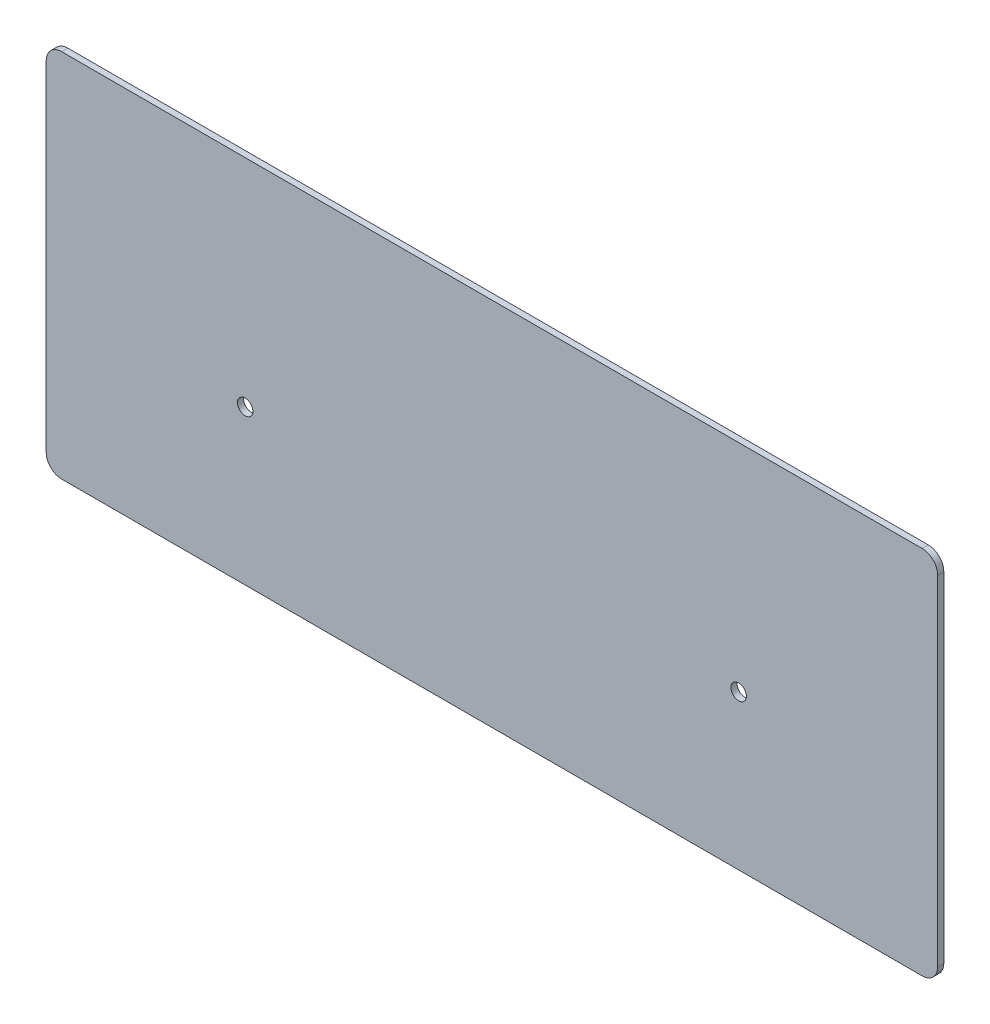
ISO-10303-21;
HEADER;
FILE_DESCRIPTION(('STEP AP214'),'2;1');
FILE_NAME('part.step','',(''),(''),'','','');
FILE_SCHEMA(('AUTOMOTIVE_DESIGN { 1 0 10303 214 1 1 1 1 }'));
ENDSEC;
DATA;
#1=APPLICATION_CONTEXT('core data for automotive mechanical design processes');
#2=APPLICATION_PROTOCOL_DEFINITION('international standard','automotive_design',2000,#1);
#3=PRODUCT_CONTEXT('',#1,'mechanical');
#4=PRODUCT('Part','Part','',(#3));
#5=PRODUCT_RELATED_PRODUCT_CATEGORY('part','',(#4));
#6=PRODUCT_DEFINITION_FORMATION('','',#4);
#7=PRODUCT_DEFINITION_CONTEXT('part definition',#1,'design');
#8=PRODUCT_DEFINITION('design','',#6,#7);
#9=PRODUCT_DEFINITION_SHAPE('','',#8);
#10=(LENGTH_UNIT() NAMED_UNIT(*) SI_UNIT(.MILLI.,.METRE.));
#11=(NAMED_UNIT(*) PLANE_ANGLE_UNIT() SI_UNIT($,.RADIAN.));
#12=(NAMED_UNIT(*) SI_UNIT($,.STERADIAN.) SOLID_ANGLE_UNIT());
#13=UNCERTAINTY_MEASURE_WITH_UNIT(LENGTH_MEASURE(1.E-05),#10,'distance_accuracy_value','');
#14=(GEOMETRIC_REPRESENTATION_CONTEXT(3) GLOBAL_UNCERTAINTY_ASSIGNED_CONTEXT((#13)) GLOBAL_UNIT_ASSIGNED_CONTEXT((#10,
#11,#12)) REPRESENTATION_CONTEXT('',''));
#15=CARTESIAN_POINT('',(0.,0.,0.));
#16=DIRECTION('',(0.,0.,1.));
#17=DIRECTION('',(1.,0.,0.));
#18=AXIS2_PLACEMENT_3D('',#15,#16,#17);
#19=CARTESIAN_POINT('',(-144.5,60.,0.));
#20=DIRECTION('',(0.,-1.,0.));
#21=DIRECTION('',(-1.,0.,0.));
#22=AXIS2_PLACEMENT_3D('',#19,#20,#21);
#23=PLANE('',#22);
#24=DIRECTION('',(0.,0.,1.));
#25=VECTOR('',#24,1.);
#26=CARTESIAN_POINT('',(139.5,60.,0.));
#27=LINE('',#26,#25);
#28=CARTESIAN_POINT('',(139.5,60.,-2.));
#29=VERTEX_POINT('',#28);
#30=CARTESIAN_POINT('',(139.5,60.,0.));
#31=VERTEX_POINT('',#30);
#32=EDGE_CURVE('E11',#29,#31,#27,.T.);
#33=ORIENTED_EDGE('',*,*,#32,.F.);
#34=DIRECTION('',(-1.,0.,0.));
#35=VECTOR('',#34,1.);
#36=CARTESIAN_POINT('',(0.,60.,-2.));
#37=LINE('',#36,#35);
#38=CARTESIAN_POINT('',(-139.5,60.,-2.));
#39=VERTEX_POINT('',#38);
#40=EDGE_CURVE('E110',#29,#39,#37,.T.);
#41=ORIENTED_EDGE('',*,*,#40,.T.);
#42=DIRECTION('',(0.,0.,1.));
#43=VECTOR('',#42,1.);
#44=CARTESIAN_POINT('',(-139.5,60.,0.));
#45=LINE('',#44,#43);
#46=CARTESIAN_POINT('',(-139.5,60.,0.));
#47=VERTEX_POINT('',#46);
#48=EDGE_CURVE('E51',#39,#47,#45,.T.);
#49=ORIENTED_EDGE('',*,*,#48,.T.);
#50=DIRECTION('',(-1.,0.,0.));
#51=VECTOR('',#50,1.);
#52=CARTESIAN_POINT('',(-144.5,60.,0.));
#53=LINE('',#52,#51);
#54=EDGE_CURVE('E154',#31,#47,#53,.T.);
#55=ORIENTED_EDGE('',*,*,#54,.F.);
#56=EDGE_LOOP('',(#33,#41,#49,#55));
#57=FACE_BOUND('',#56,.T.);
#58=ADVANCED_FACE('F41',(#57),#23,.F.);
#59=CARTESIAN_POINT('',(-139.5,55.,0.));
#60=DIRECTION('',(0.,0.,-1.));
#61=DIRECTION('',(-1.,0.,0.));
#62=AXIS2_PLACEMENT_3D('',#59,#60,#61);
#63=CYLINDRICAL_SURFACE('',#62,5.);
#64=ORIENTED_EDGE('',*,*,#48,.F.);
#65=CARTESIAN_POINT('',(-139.5,55.,-2.));
#66=DIRECTION('',(0.,0.,-1.));
#67=DIRECTION('',(-1.,0.,0.));
#68=AXIS2_PLACEMENT_3D('',#65,#66,#67);
#69=CIRCLE('',#68,5.);
#70=CARTESIAN_POINT('',(-144.5,55.,-2.));
#71=VERTEX_POINT('',#70);
#72=EDGE_CURVE('E131',#39,#71,#69,.F.);
#73=ORIENTED_EDGE('',*,*,#72,.T.);
#74=DIRECTION('',(0.,0.,1.));
#75=VECTOR('',#74,1.);
#76=CARTESIAN_POINT('',(-144.5,55.,0.));
#77=LINE('',#76,#75);
#78=CARTESIAN_POINT('',(-144.5,55.,0.));
#79=VERTEX_POINT('',#78);
#80=EDGE_CURVE('E147',#71,#79,#77,.T.);
#81=ORIENTED_EDGE('',*,*,#80,.T.);
#82=CARTESIAN_POINT('',(-139.5,55.,0.));
#83=DIRECTION('',(0.,0.,-1.));
#84=DIRECTION('',(-1.,0.,0.));
#85=AXIS2_PLACEMENT_3D('',#82,#83,#84);
#86=CIRCLE('',#85,5.);
#87=EDGE_CURVE('E164',#47,#79,#86,.F.);
#88=ORIENTED_EDGE('',*,*,#87,.F.);
#89=EDGE_LOOP('',(#64,#73,#81,#88));
#90=FACE_BOUND('',#89,.T.);
#91=ADVANCED_FACE('F167',(#90),#63,.T.);
#92=CARTESIAN_POINT('',(-144.5,-60.,0.));
#93=DIRECTION('',(1.,0.,0.));
#94=DIRECTION('',(0.,-1.,0.));
#95=AXIS2_PLACEMENT_3D('',#92,#93,#94);
#96=PLANE('',#95);
#97=ORIENTED_EDGE('',*,*,#80,.F.);
#98=DIRECTION('',(0.,1.,0.));
#99=VECTOR('',#98,1.);
#100=CARTESIAN_POINT('',(-144.5,0.,-2.));
#101=LINE('',#100,#99);
#102=CARTESIAN_POINT('',(-144.5,-55.,-2.));
#103=VERTEX_POINT('',#102);
#104=EDGE_CURVE('E128',#71,#103,#101,.F.);
#105=ORIENTED_EDGE('',*,*,#104,.T.);
#106=DIRECTION('',(0.,0.,1.));
#107=VECTOR('',#106,1.);
#108=CARTESIAN_POINT('',(-144.5,-55.,0.));
#109=LINE('',#108,#107);
#110=CARTESIAN_POINT('',(-144.5,-55.,0.));
#111=VERTEX_POINT('',#110);
#112=EDGE_CURVE('E144',#103,#111,#109,.T.);
#113=ORIENTED_EDGE('',*,*,#112,.T.);
#114=DIRECTION('',(0.,-1.,0.));
#115=VECTOR('',#114,1.);
#116=CARTESIAN_POINT('',(-144.5,-60.,0.));
#117=LINE('',#116,#115);
#118=EDGE_CURVE('E168',#79,#111,#117,.T.);
#119=ORIENTED_EDGE('',*,*,#118,.F.);
#120=EDGE_LOOP('',(#97,#105,#113,#119));
#121=FACE_BOUND('',#120,.T.);
#122=ADVANCED_FACE('F200',(#121),#96,.F.);
#123=CARTESIAN_POINT('',(-139.5,-55.,0.));
#124=DIRECTION('',(0.,0.,-1.));
#125=DIRECTION('',(-1.,0.,0.));
#126=AXIS2_PLACEMENT_3D('',#123,#124,#125);
#127=CYLINDRICAL_SURFACE('',#126,5.);
#128=ORIENTED_EDGE('',*,*,#112,.F.);
#129=CARTESIAN_POINT('',(-139.5,-55.,-2.));
#130=DIRECTION('',(0.,0.,-1.));
#131=DIRECTION('',(-1.,0.,0.));
#132=AXIS2_PLACEMENT_3D('',#129,#130,#131);
#133=CIRCLE('',#132,5.);
#134=CARTESIAN_POINT('',(-139.5,-60.,-2.));
#135=VERTEX_POINT('',#134);
#136=EDGE_CURVE('E125',#103,#135,#133,.F.);
#137=ORIENTED_EDGE('',*,*,#136,.T.);
#138=DIRECTION('',(0.,0.,1.));
#139=VECTOR('',#138,1.);
#140=CARTESIAN_POINT('',(-139.5,-60.,0.));
#141=LINE('',#140,#139);
#142=CARTESIAN_POINT('',(-139.5,-60.,0.));
#143=VERTEX_POINT('',#142);
#144=EDGE_CURVE('E141',#135,#143,#141,.T.);
#145=ORIENTED_EDGE('',*,*,#144,.T.);
#146=CARTESIAN_POINT('',(-139.5,-55.,0.));
#147=DIRECTION('',(0.,0.,-1.));
#148=DIRECTION('',(-1.,0.,0.));
#149=AXIS2_PLACEMENT_3D('',#146,#147,#148);
#150=CIRCLE('',#149,5.);
#151=EDGE_CURVE('E170',#111,#143,#150,.F.);
#152=ORIENTED_EDGE('',*,*,#151,.F.);
#153=EDGE_LOOP('',(#128,#137,#145,#152));
#154=FACE_BOUND('',#153,.T.);
#155=ADVANCED_FACE('F223',(#154),#127,.T.);
#156=CARTESIAN_POINT('',(-144.5,-60.,0.));
#157=DIRECTION('',(0.,1.,0.));
#158=DIRECTION('',(1.,0.,0.));
#159=AXIS2_PLACEMENT_3D('',#156,#157,#158);
#160=PLANE('',#159);
#161=ORIENTED_EDGE('',*,*,#144,.F.);
#162=DIRECTION('',(-1.,0.,0.));
#163=VECTOR('',#162,1.);
#164=CARTESIAN_POINT('',(0.,-60.,-2.));
#165=LINE('',#164,#163);
#166=CARTESIAN_POINT('',(139.5,-60.,-2.));
#167=VERTEX_POINT('',#166);
#168=EDGE_CURVE('E122',#135,#167,#165,.F.);
#169=ORIENTED_EDGE('',*,*,#168,.T.);
#170=DIRECTION('',(0.,0.,1.));
#171=VECTOR('',#170,1.);
#172=CARTESIAN_POINT('',(139.5,-60.,0.));
#173=LINE('',#172,#171);
#174=CARTESIAN_POINT('',(139.5,-60.,0.));
#175=VERTEX_POINT('',#174);
#176=EDGE_CURVE('E139',#167,#175,#173,.T.);
#177=ORIENTED_EDGE('',*,*,#176,.T.);
#178=DIRECTION('',(1.,0.,0.));
#179=VECTOR('',#178,1.);
#180=CARTESIAN_POINT('',(-144.5,-60.,0.));
#181=LINE('',#180,#179);
#182=EDGE_CURVE('E176',#143,#175,#181,.T.);
#183=ORIENTED_EDGE('',*,*,#182,.F.);
#184=EDGE_LOOP('',(#161,#169,#177,#183));
#185=FACE_BOUND('',#184,.T.);
#186=ADVANCED_FACE('F220',(#185),#160,.F.);
#187=CARTESIAN_POINT('',(139.5,-55.,0.));
#188=DIRECTION('',(0.,0.,-1.));
#189=DIRECTION('',(-1.,0.,0.));
#190=AXIS2_PLACEMENT_3D('',#187,#188,#189);
#191=CYLINDRICAL_SURFACE('',#190,5.);
#192=ORIENTED_EDGE('',*,*,#176,.F.);
#193=CARTESIAN_POINT('',(139.5,-55.,-2.));
#194=DIRECTION('',(0.,0.,-1.));
#195=DIRECTION('',(-1.,0.,0.));
#196=AXIS2_PLACEMENT_3D('',#193,#194,#195);
#197=CIRCLE('',#196,5.);
#198=CARTESIAN_POINT('',(144.5,-55.,-2.));
#199=VERTEX_POINT('',#198);
#200=EDGE_CURVE('E119',#167,#199,#197,.F.);
#201=ORIENTED_EDGE('',*,*,#200,.T.);
#202=DIRECTION('',(0.,0.,1.));
#203=VECTOR('',#202,1.);
#204=CARTESIAN_POINT('',(144.5,-55.,0.));
#205=LINE('',#204,#203);
#206=CARTESIAN_POINT('',(144.5,-55.,0.));
#207=VERTEX_POINT('',#206);
#208=EDGE_CURVE('E59',#199,#207,#205,.T.);
#209=ORIENTED_EDGE('',*,*,#208,.T.);
#210=CARTESIAN_POINT('',(139.5,-55.,0.));
#211=DIRECTION('',(0.,0.,-1.));
#212=DIRECTION('',(-1.,0.,0.));
#213=AXIS2_PLACEMENT_3D('',#210,#211,#212);
#214=CIRCLE('',#213,5.);
#215=EDGE_CURVE('E179',#175,#207,#214,.F.);
#216=ORIENTED_EDGE('',*,*,#215,.F.);
#217=EDGE_LOOP('',(#192,#201,#209,#216));
#218=FACE_BOUND('',#217,.T.);
#219=ADVANCED_FACE('F213',(#218),#191,.T.);
#220=CARTESIAN_POINT('',(144.5,-60.,0.));
#221=DIRECTION('',(-1.,0.,0.));
#222=DIRECTION('',(0.,1.,0.));
#223=AXIS2_PLACEMENT_3D('',#220,#221,#222);
#224=PLANE('',#223);
#225=ORIENTED_EDGE('',*,*,#208,.F.);
#226=DIRECTION('',(0.,1.,0.));
#227=VECTOR('',#226,1.);
#228=CARTESIAN_POINT('',(144.5,0.,-2.));
#229=LINE('',#228,#227);
#230=CARTESIAN_POINT('',(144.5,55.,-2.));
#231=VERTEX_POINT('',#230);
#232=EDGE_CURVE('E108',#199,#231,#229,.T.);
#233=ORIENTED_EDGE('',*,*,#232,.T.);
#234=DIRECTION('',(0.,0.,1.));
#235=VECTOR('',#234,1.);
#236=CARTESIAN_POINT('',(144.5,55.,0.));
#237=LINE('',#236,#235);
#238=CARTESIAN_POINT('',(144.5,55.,0.));
#239=VERTEX_POINT('',#238);
#240=EDGE_CURVE('E45',#231,#239,#237,.T.);
#241=ORIENTED_EDGE('',*,*,#240,.T.);
#242=DIRECTION('',(0.,1.,0.));
#243=VECTOR('',#242,1.);
#244=CARTESIAN_POINT('',(144.5,-60.,0.));
#245=LINE('',#244,#243);
#246=EDGE_CURVE('E238',#207,#239,#245,.T.);
#247=ORIENTED_EDGE('',*,*,#246,.F.);
#248=EDGE_LOOP('',(#225,#233,#241,#247));
#249=FACE_BOUND('',#248,.T.);
#250=ADVANCED_FACE('F112',(#249),#224,.F.);
#251=CARTESIAN_POINT('',(80.,-9.99999999999997,0.));
#252=DIRECTION('',(0.,0.,-1.));
#253=DIRECTION('',(-1.,0.,0.));
#254=AXIS2_PLACEMENT_3D('',#251,#252,#253);
#255=CYLINDRICAL_SURFACE('',#254,2.5);
#256=CARTESIAN_POINT('',(80.,-9.99999999999997,0.));
#257=DIRECTION('',(0.,0.,1.));
#258=DIRECTION('',(1.,0.,0.));
#259=AXIS2_PLACEMENT_3D('',#256,#257,#258);
#260=CIRCLE('',#259,2.5);
#261=CARTESIAN_POINT('',(82.5,-9.99999999999997,0.));
#262=VERTEX_POINT('',#261);
#263=EDGE_CURVE('E137',#262,#262,#260,.T.);
#264=ORIENTED_EDGE('',*,*,#263,.T.);
#265=EDGE_LOOP('',(#264));
#266=FACE_BOUND('',#265,.T.);
#267=CARTESIAN_POINT('',(80.,-9.99999999999997,-2.));
#268=DIRECTION('',(0.,0.,1.));
#269=DIRECTION('',(1.,0.,0.));
#270=AXIS2_PLACEMENT_3D('',#267,#268,#269);
#271=CIRCLE('',#270,2.5);
#272=CARTESIAN_POINT('',(82.5,-9.99999999999997,-2.));
#273=VERTEX_POINT('',#272);
#274=EDGE_CURVE('E113',#273,#273,#271,.T.);
#275=ORIENTED_EDGE('',*,*,#274,.F.);
#276=EDGE_LOOP('',(#275));
#277=FACE_BOUND('',#276,.T.);
#278=ADVANCED_FACE('F204',(#266,#277),#255,.F.);
#279=CARTESIAN_POINT('',(139.5,55.,0.));
#280=DIRECTION('',(0.,0.,-1.));
#281=DIRECTION('',(-1.,0.,0.));
#282=AXIS2_PLACEMENT_3D('',#279,#280,#281);
#283=CYLINDRICAL_SURFACE('',#282,5.);
#284=CARTESIAN_POINT('',(139.5,55.,-2.));
#285=DIRECTION('',(0.,0.,-1.));
#286=DIRECTION('',(-1.,0.,0.));
#287=AXIS2_PLACEMENT_3D('',#284,#285,#286);
#288=CIRCLE('',#287,5.);
#289=EDGE_CURVE('E96',#231,#29,#288,.F.);
#290=ORIENTED_EDGE('',*,*,#289,.T.);
#291=ORIENTED_EDGE('',*,*,#32,.T.);
#292=CARTESIAN_POINT('',(139.5,55.,0.));
#293=DIRECTION('',(0.,0.,-1.));
#294=DIRECTION('',(-1.,0.,0.));
#295=AXIS2_PLACEMENT_3D('',#292,#293,#294);
#296=CIRCLE('',#295,5.);
#297=EDGE_CURVE('E98',#239,#31,#296,.F.);
#298=ORIENTED_EDGE('',*,*,#297,.F.);
#299=ORIENTED_EDGE('',*,*,#240,.F.);
#300=EDGE_LOOP('',(#290,#291,#298,#299));
#301=FACE_BOUND('',#300,.T.);
#302=ADVANCED_FACE('F95',(#301),#283,.T.);
#303=CARTESIAN_POINT('',(-80.,-9.99999999999999,0.));
#304=DIRECTION('',(0.,0.,-1.));
#305=DIRECTION('',(-1.,0.,0.));
#306=AXIS2_PLACEMENT_3D('',#303,#304,#305);
#307=CYLINDRICAL_SURFACE('',#306,2.5);
#308=CARTESIAN_POINT('',(-80.,-9.99999999999999,0.));
#309=DIRECTION('',(0.,0.,1.));
#310=DIRECTION('',(1.,0.,0.));
#311=AXIS2_PLACEMENT_3D('',#308,#309,#310);
#312=CIRCLE('',#311,2.5);
#313=CARTESIAN_POINT('',(-77.5,-9.99999999999999,0.));
#314=VERTEX_POINT('',#313);
#315=EDGE_CURVE('E102',#314,#314,#312,.T.);
#316=ORIENTED_EDGE('',*,*,#315,.T.);
#317=EDGE_LOOP('',(#316));
#318=FACE_BOUND('',#317,.T.);
#319=CARTESIAN_POINT('',(-80.,-9.99999999999999,-2.));
#320=DIRECTION('',(0.,0.,1.));
#321=DIRECTION('',(1.,0.,0.));
#322=AXIS2_PLACEMENT_3D('',#319,#320,#321);
#323=CIRCLE('',#322,2.5);
#324=CARTESIAN_POINT('',(-77.5,-9.99999999999999,-2.));
#325=VERTEX_POINT('',#324);
#326=EDGE_CURVE('E121',#325,#325,#323,.T.);
#327=ORIENTED_EDGE('',*,*,#326,.F.);
#328=EDGE_LOOP('',(#327));
#329=FACE_BOUND('',#328,.T.);
#330=ADVANCED_FACE('F43',(#318,#329),#307,.F.);
#331=CARTESIAN_POINT('',(0.,0.,0.));
#332=DIRECTION('',(0.,0.,-1.));
#333=DIRECTION('',(-1.,0.,0.));
#334=AXIS2_PLACEMENT_3D('',#331,#332,#333);
#335=PLANE('',#334);
#336=ORIENTED_EDGE('',*,*,#263,.F.);
#337=EDGE_LOOP('',(#336));
#338=FACE_BOUND('',#337,.T.);
#339=ORIENTED_EDGE('',*,*,#246,.T.);
#340=ORIENTED_EDGE('',*,*,#297,.T.);
#341=ORIENTED_EDGE('',*,*,#54,.T.);
#342=ORIENTED_EDGE('',*,*,#87,.T.);
#343=ORIENTED_EDGE('',*,*,#118,.T.);
#344=ORIENTED_EDGE('',*,*,#151,.T.);
#345=ORIENTED_EDGE('',*,*,#182,.T.);
#346=ORIENTED_EDGE('',*,*,#215,.T.);
#347=EDGE_LOOP('',(#339,#340,#341,#342,#343,#344,#345,#346));
#348=FACE_BOUND('',#347,.T.);
#349=ORIENTED_EDGE('',*,*,#315,.F.);
#350=EDGE_LOOP('',(#349));
#351=FACE_BOUND('',#350,.T.);
#352=ADVANCED_FACE('F161',(#338,#348,#351),#335,.F.);
#353=CARTESIAN_POINT('',(0.,0.,-2.));
#354=DIRECTION('',(0.,0.,-1.));
#355=DIRECTION('',(-1.,0.,0.));
#356=AXIS2_PLACEMENT_3D('',#353,#354,#355);
#357=PLANE('',#356);
#358=ORIENTED_EDGE('',*,*,#274,.T.);
#359=EDGE_LOOP('',(#358));
#360=FACE_BOUND('',#359,.T.);
#361=ORIENTED_EDGE('',*,*,#232,.F.);
#362=ORIENTED_EDGE('',*,*,#200,.F.);
#363=ORIENTED_EDGE('',*,*,#168,.F.);
#364=ORIENTED_EDGE('',*,*,#136,.F.);
#365=ORIENTED_EDGE('',*,*,#104,.F.);
#366=ORIENTED_EDGE('',*,*,#72,.F.);
#367=ORIENTED_EDGE('',*,*,#40,.F.);
#368=ORIENTED_EDGE('',*,*,#289,.F.);
#369=EDGE_LOOP('',(#361,#362,#363,#364,#365,#366,#367,#368));
#370=FACE_BOUND('',#369,.T.);
#371=ORIENTED_EDGE('',*,*,#326,.T.);
#372=EDGE_LOOP('',(#371));
#373=FACE_BOUND('',#372,.T.);
#374=ADVANCED_FACE('F105',(#360,#370,#373),#357,.T.);
#375=CLOSED_SHELL('',(#58,#91,#122,#155,#186,#219,#250,#278,#302,#330,#352,#374));
#376=MANIFOLD_SOLID_BREP('B2',#375);
#377=ADVANCED_BREP_SHAPE_REPRESENTATION('',(#18,#376),#14);
#378=SHAPE_DEFINITION_REPRESENTATION(#9,#377);
ENDSEC;
END-ISO-10303-21;
